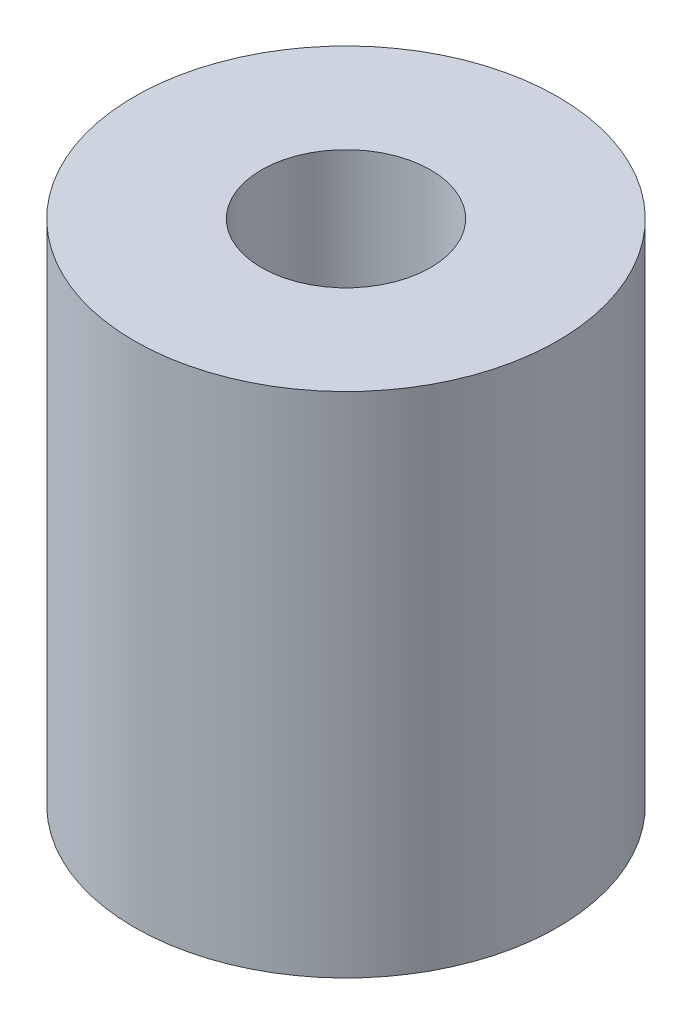
ISO-10303-21;
HEADER;
FILE_DESCRIPTION(('STEP AP214'),'2;1');
FILE_NAME('part.step','',(''),(''),'','','');
FILE_SCHEMA(('AUTOMOTIVE_DESIGN { 1 0 10303 214 1 1 1 1 }'));
ENDSEC;
DATA;
#1=APPLICATION_CONTEXT('core data for automotive mechanical design processes');
#2=APPLICATION_PROTOCOL_DEFINITION('international standard','automotive_design',2000,#1);
#3=PRODUCT_CONTEXT('',#1,'mechanical');
#4=PRODUCT('Part','Part','',(#3));
#5=PRODUCT_RELATED_PRODUCT_CATEGORY('part','',(#4));
#6=PRODUCT_DEFINITION_FORMATION('','',#4);
#7=PRODUCT_DEFINITION_CONTEXT('part definition',#1,'design');
#8=PRODUCT_DEFINITION('design','',#6,#7);
#9=PRODUCT_DEFINITION_SHAPE('','',#8);
#10=(LENGTH_UNIT() NAMED_UNIT(*) SI_UNIT(.MILLI.,.METRE.));
#11=(NAMED_UNIT(*) PLANE_ANGLE_UNIT() SI_UNIT($,.RADIAN.));
#12=(NAMED_UNIT(*) SI_UNIT($,.STERADIAN.) SOLID_ANGLE_UNIT());
#13=UNCERTAINTY_MEASURE_WITH_UNIT(LENGTH_MEASURE(1.E-05),#10,'distance_accuracy_value','');
#14=(GEOMETRIC_REPRESENTATION_CONTEXT(3) GLOBAL_UNCERTAINTY_ASSIGNED_CONTEXT((#13)) GLOBAL_UNIT_ASSIGNED_CONTEXT((#10,
#11,#12)) REPRESENTATION_CONTEXT('',''));
#15=CARTESIAN_POINT('',(0.,0.,0.));
#16=DIRECTION('',(0.,0.,1.));
#17=DIRECTION('',(1.,0.,0.));
#18=AXIS2_PLACEMENT_3D('',#15,#16,#17);
#19=CARTESIAN_POINT('',(0.,6.,0.));
#20=DIRECTION('',(0.,1.,0.));
#21=DIRECTION('',(0.,0.,1.));
#22=AXIS2_PLACEMENT_3D('',#19,#20,#21);
#23=PLANE('',#22);
#24=CARTESIAN_POINT('',(0.,6.,0.));
#25=DIRECTION('',(0.,1.,0.));
#26=DIRECTION('',(0.,0.,1.));
#27=AXIS2_PLACEMENT_3D('',#24,#25,#26);
#28=CIRCLE('',#27,2.5);
#29=CARTESIAN_POINT('',(0.,6.,2.5));
#30=VERTEX_POINT('',#29);
#31=EDGE_CURVE('E10',#30,#30,#28,.T.);
#32=ORIENTED_EDGE('',*,*,#31,.T.);
#33=EDGE_LOOP('',(#32));
#34=FACE_BOUND('',#33,.T.);
#35=CARTESIAN_POINT('',(0.,6.,0.));
#36=DIRECTION('',(0.,1.,0.));
#37=DIRECTION('',(0.,0.,1.));
#38=AXIS2_PLACEMENT_3D('',#35,#36,#37);
#39=CIRCLE('',#38,1.);
#40=CARTESIAN_POINT('',(0.,6.,1.));
#41=VERTEX_POINT('',#40);
#42=EDGE_CURVE('E44',#41,#41,#39,.T.);
#43=ORIENTED_EDGE('',*,*,#42,.F.);
#44=EDGE_LOOP('',(#43));
#45=FACE_BOUND('',#44,.T.);
#46=ADVANCED_FACE('F33',(#34,#45),#23,.T.);
#47=CARTESIAN_POINT('',(0.,0.,0.));
#48=DIRECTION('',(0.,1.,0.));
#49=DIRECTION('',(0.,0.,1.));
#50=AXIS2_PLACEMENT_3D('',#47,#48,#49);
#51=PLANE('',#50);
#52=CARTESIAN_POINT('',(0.,0.,0.));
#53=DIRECTION('',(0.,1.,0.));
#54=DIRECTION('',(0.,0.,1.));
#55=AXIS2_PLACEMENT_3D('',#52,#53,#54);
#56=CIRCLE('',#55,2.5);
#57=CARTESIAN_POINT('',(0.,0.,2.5));
#58=VERTEX_POINT('',#57);
#59=EDGE_CURVE('E37',#58,#58,#56,.T.);
#60=ORIENTED_EDGE('',*,*,#59,.F.);
#61=EDGE_LOOP('',(#60));
#62=FACE_BOUND('',#61,.T.);
#63=CARTESIAN_POINT('',(0.,0.,0.));
#64=DIRECTION('',(0.,1.,0.));
#65=DIRECTION('',(0.,0.,1.));
#66=AXIS2_PLACEMENT_3D('',#63,#64,#65);
#67=CIRCLE('',#66,1.);
#68=CARTESIAN_POINT('',(0.,0.,1.));
#69=VERTEX_POINT('',#68);
#70=EDGE_CURVE('E46',#69,#69,#67,.T.);
#71=ORIENTED_EDGE('',*,*,#70,.T.);
#72=EDGE_LOOP('',(#71));
#73=FACE_BOUND('',#72,.T.);
#74=ADVANCED_FACE('F56',(#62,#73),#51,.F.);
#75=CARTESIAN_POINT('',(0.,6.,0.));
#76=DIRECTION('',(0.,-1.,0.));
#77=DIRECTION('',(0.,0.,-1.));
#78=AXIS2_PLACEMENT_3D('',#75,#76,#77);
#79=CYLINDRICAL_SURFACE('',#78,2.5);
#80=ORIENTED_EDGE('',*,*,#31,.F.);
#81=EDGE_LOOP('',(#80));
#82=FACE_BOUND('',#81,.T.);
#83=ORIENTED_EDGE('',*,*,#59,.T.);
#84=EDGE_LOOP('',(#83));
#85=FACE_BOUND('',#84,.T.);
#86=ADVANCED_FACE('F35',(#82,#85),#79,.T.);
#87=CARTESIAN_POINT('',(0.,6.,0.));
#88=DIRECTION('',(0.,-1.,0.));
#89=DIRECTION('',(0.,0.,-1.));
#90=AXIS2_PLACEMENT_3D('',#87,#88,#89);
#91=CYLINDRICAL_SURFACE('',#90,1.);
#92=ORIENTED_EDGE('',*,*,#42,.T.);
#93=EDGE_LOOP('',(#92));
#94=FACE_BOUND('',#93,.T.);
#95=ORIENTED_EDGE('',*,*,#70,.F.);
#96=EDGE_LOOP('',(#95));
#97=FACE_BOUND('',#96,.T.);
#98=ADVANCED_FACE('F52',(#94,#97),#91,.F.);
#99=CLOSED_SHELL('',(#46,#74,#86,#98));
#100=MANIFOLD_SOLID_BREP('B2',#99);
#101=ADVANCED_BREP_SHAPE_REPRESENTATION('',(#18,#100),#14);
#102=SHAPE_DEFINITION_REPRESENTATION(#9,#101);
ENDSEC;
END-ISO-10303-21;
